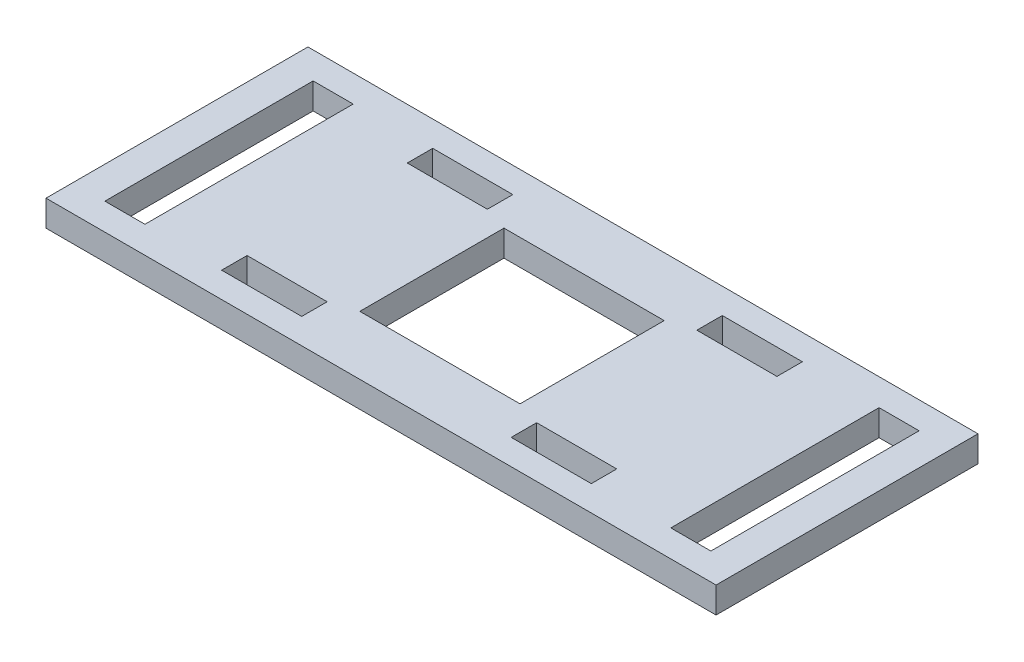
ISO-10303-21;
HEADER;
FILE_DESCRIPTION(('STEP AP214'),'2;1');
FILE_NAME('part.step','',(''),(''),'','','');
FILE_SCHEMA(('AUTOMOTIVE_DESIGN { 1 0 10303 214 1 1 1 1 }'));
ENDSEC;
DATA;
#1=APPLICATION_CONTEXT('core data for automotive mechanical design processes');
#2=APPLICATION_PROTOCOL_DEFINITION('international standard','automotive_design',2000,#1);
#3=PRODUCT_CONTEXT('',#1,'mechanical');
#4=PRODUCT('Part','Part','',(#3));
#5=PRODUCT_RELATED_PRODUCT_CATEGORY('part','',(#4));
#6=PRODUCT_DEFINITION_FORMATION('','',#4);
#7=PRODUCT_DEFINITION_CONTEXT('part definition',#1,'design');
#8=PRODUCT_DEFINITION('design','',#6,#7);
#9=PRODUCT_DEFINITION_SHAPE('','',#8);
#10=(LENGTH_UNIT() NAMED_UNIT(*) SI_UNIT(.MILLI.,.METRE.));
#11=(NAMED_UNIT(*) PLANE_ANGLE_UNIT() SI_UNIT($,.RADIAN.));
#12=(NAMED_UNIT(*) SI_UNIT($,.STERADIAN.) SOLID_ANGLE_UNIT());
#13=UNCERTAINTY_MEASURE_WITH_UNIT(LENGTH_MEASURE(1.E-05),#10,'distance_accuracy_value','');
#14=(GEOMETRIC_REPRESENTATION_CONTEXT(3) GLOBAL_UNCERTAINTY_ASSIGNED_CONTEXT((#13)) GLOBAL_UNIT_ASSIGNED_CONTEXT((#10,
#11,#12)) REPRESENTATION_CONTEXT('',''));
#15=CARTESIAN_POINT('',(0.,0.,0.));
#16=DIRECTION('',(0.,0.,1.));
#17=DIRECTION('',(1.,0.,0.));
#18=AXIS2_PLACEMENT_3D('',#15,#16,#17);
#19=CARTESIAN_POINT('',(0.,3.25,0.));
#20=DIRECTION('',(0.,-1.,0.));
#21=DIRECTION('',(0.,0.,-1.));
#22=AXIS2_PLACEMENT_3D('',#19,#20,#21);
#23=PLANE('',#22);
#24=DIRECTION('',(-1.,0.,0.));
#25=VECTOR('',#24,1.);
#26=CARTESIAN_POINT('',(-23.075,3.25,10.));
#27=LINE('',#26,#25);
#28=CARTESIAN_POINT('',(-13.075,3.25,10.));
#29=VERTEX_POINT('',#28);
#30=CARTESIAN_POINT('',(-23.075,3.25,10.));
#31=VERTEX_POINT('',#30);
#32=EDGE_CURVE('E277',#29,#31,#27,.T.);
#33=ORIENTED_EDGE('',*,*,#32,.F.);
#34=DIRECTION('',(0.,0.,-1.));
#35=VECTOR('',#34,1.);
#36=CARTESIAN_POINT('',(-13.075,3.25,10.));
#37=LINE('',#36,#35);
#38=CARTESIAN_POINT('',(-13.075,3.25,13.175));
#39=VERTEX_POINT('',#38);
#40=EDGE_CURVE('E285',#39,#29,#37,.T.);
#41=ORIENTED_EDGE('',*,*,#40,.F.);
#42=DIRECTION('',(1.,0.,0.));
#43=VECTOR('',#42,1.);
#44=CARTESIAN_POINT('',(-23.075,3.25,13.175));
#45=LINE('',#44,#43);
#46=CARTESIAN_POINT('',(-23.075,3.25,13.175));
#47=VERTEX_POINT('',#46);
#48=EDGE_CURVE('E282',#47,#39,#45,.T.);
#49=ORIENTED_EDGE('',*,*,#48,.F.);
#50=DIRECTION('',(0.,0.,1.));
#51=VECTOR('',#50,1.);
#52=CARTESIAN_POINT('',(-23.075,3.25,10.));
#53=LINE('',#52,#51);
#54=EDGE_CURVE('E279',#31,#47,#53,.T.);
#55=ORIENTED_EDGE('',*,*,#54,.F.);
#56=EDGE_LOOP('',(#33,#41,#49,#55));
#57=FACE_BOUND('',#56,.T.);
#58=DIRECTION('',(1.,0.,0.));
#59=VECTOR('',#58,1.);
#60=CARTESIAN_POINT('',(23.075,3.25,-10.));
#61=LINE('',#60,#59);
#62=CARTESIAN_POINT('',(13.075,3.25,-10.));
#63=VERTEX_POINT('',#62);
#64=CARTESIAN_POINT('',(23.075,3.25,-10.));
#65=VERTEX_POINT('',#64);
#66=EDGE_CURVE('E339',#63,#65,#61,.T.);
#67=ORIENTED_EDGE('',*,*,#66,.F.);
#68=DIRECTION('',(0.,0.,1.));
#69=VECTOR('',#68,1.);
#70=CARTESIAN_POINT('',(13.075,3.25,-10.));
#71=LINE('',#70,#69);
#72=CARTESIAN_POINT('',(13.075,3.25,-13.175));
#73=VERTEX_POINT('',#72);
#74=EDGE_CURVE('E347',#73,#63,#71,.T.);
#75=ORIENTED_EDGE('',*,*,#74,.F.);
#76=DIRECTION('',(-1.,0.,0.));
#77=VECTOR('',#76,1.);
#78=CARTESIAN_POINT('',(23.075,3.25,-13.175));
#79=LINE('',#78,#77);
#80=CARTESIAN_POINT('',(23.075,3.25,-13.175));
#81=VERTEX_POINT('',#80);
#82=EDGE_CURVE('E344',#81,#73,#79,.T.);
#83=ORIENTED_EDGE('',*,*,#82,.F.);
#84=DIRECTION('',(0.,0.,-1.));
#85=VECTOR('',#84,1.);
#86=CARTESIAN_POINT('',(23.075,3.25,-10.));
#87=LINE('',#86,#85);
#88=EDGE_CURVE('E341',#65,#81,#87,.T.);
#89=ORIENTED_EDGE('',*,*,#88,.F.);
#90=EDGE_LOOP('',(#67,#75,#83,#89));
#91=FACE_BOUND('',#90,.T.);
#92=DIRECTION('',(0.,0.,1.));
#93=VECTOR('',#92,1.);
#94=CARTESIAN_POINT('',(-23.075,3.25,-10.));
#95=LINE('',#94,#93);
#96=CARTESIAN_POINT('',(-23.075,3.25,-13.175));
#97=VERTEX_POINT('',#96);
#98=CARTESIAN_POINT('',(-23.075,3.25,-10.));
#99=VERTEX_POINT('',#98);
#100=EDGE_CURVE('E401',#97,#99,#95,.T.);
#101=ORIENTED_EDGE('',*,*,#100,.F.);
#102=DIRECTION('',(-1.,0.,0.));
#103=VECTOR('',#102,1.);
#104=CARTESIAN_POINT('',(-23.075,3.25,-13.175));
#105=LINE('',#104,#103);
#106=CARTESIAN_POINT('',(-13.075,3.25,-13.175));
#107=VERTEX_POINT('',#106);
#108=EDGE_CURVE('E409',#107,#97,#105,.T.);
#109=ORIENTED_EDGE('',*,*,#108,.F.);
#110=DIRECTION('',(0.,0.,-1.));
#111=VECTOR('',#110,1.);
#112=CARTESIAN_POINT('',(-13.075,3.25,-10.));
#113=LINE('',#112,#111);
#114=CARTESIAN_POINT('',(-13.075,3.25,-10.));
#115=VERTEX_POINT('',#114);
#116=EDGE_CURVE('E406',#115,#107,#113,.T.);
#117=ORIENTED_EDGE('',*,*,#116,.F.);
#118=DIRECTION('',(1.,0.,0.));
#119=VECTOR('',#118,1.);
#120=CARTESIAN_POINT('',(-23.075,3.25,-10.));
#121=LINE('',#120,#119);
#122=EDGE_CURVE('E403',#99,#115,#121,.T.);
#123=ORIENTED_EDGE('',*,*,#122,.F.);
#124=EDGE_LOOP('',(#101,#109,#117,#123));
#125=FACE_BOUND('',#124,.T.);
#126=DIRECTION('',(0.,0.,-1.));
#127=VECTOR('',#126,1.);
#128=CARTESIAN_POINT('',(41.825,3.25,16.35));
#129=LINE('',#128,#127);
#130=CARTESIAN_POINT('',(41.825,3.25,16.35));
#131=VERTEX_POINT('',#130);
#132=CARTESIAN_POINT('',(41.825,3.25,-16.35));
#133=VERTEX_POINT('',#132);
#134=EDGE_CURVE('E463',#131,#133,#129,.T.);
#135=ORIENTED_EDGE('',*,*,#134,.T.);
#136=DIRECTION('',(-1.,0.,0.));
#137=VECTOR('',#136,1.);
#138=CARTESIAN_POINT('',(-41.825,3.25,-16.35));
#139=LINE('',#138,#137);
#140=CARTESIAN_POINT('',(-41.825,3.25,-16.35));
#141=VERTEX_POINT('',#140);
#142=EDGE_CURVE('E466',#133,#141,#139,.T.);
#143=ORIENTED_EDGE('',*,*,#142,.T.);
#144=DIRECTION('',(0.,0.,1.));
#145=VECTOR('',#144,1.);
#146=CARTESIAN_POINT('',(-41.825,3.25,16.35));
#147=LINE('',#146,#145);
#148=CARTESIAN_POINT('',(-41.825,3.25,16.35));
#149=VERTEX_POINT('',#148);
#150=EDGE_CURVE('E469',#141,#149,#147,.T.);
#151=ORIENTED_EDGE('',*,*,#150,.T.);
#152=DIRECTION('',(1.,0.,0.));
#153=VECTOR('',#152,1.);
#154=CARTESIAN_POINT('',(-41.825,3.25,16.35));
#155=LINE('',#154,#153);
#156=EDGE_CURVE('E471',#149,#131,#155,.T.);
#157=ORIENTED_EDGE('',*,*,#156,.T.);
#158=EDGE_LOOP('',(#135,#143,#151,#157));
#159=FACE_BOUND('',#158,.T.);
#160=DIRECTION('',(0.,0.,-1.));
#161=VECTOR('',#160,1.);
#162=CARTESIAN_POINT('',(-32.825,3.25,13.));
#163=LINE('',#162,#161);
#164=CARTESIAN_POINT('',(-32.825,3.25,13.));
#165=VERTEX_POINT('',#164);
#166=CARTESIAN_POINT('',(-32.825,3.25,-13.));
#167=VERTEX_POINT('',#166);
#168=EDGE_CURVE('E432',#165,#167,#163,.T.);
#169=ORIENTED_EDGE('',*,*,#168,.F.);
#170=DIRECTION('',(1.,0.,0.));
#171=VECTOR('',#170,1.);
#172=CARTESIAN_POINT('',(-37.825,3.25,13.));
#173=LINE('',#172,#171);
#174=CARTESIAN_POINT('',(-37.825,3.25,13.));
#175=VERTEX_POINT('',#174);
#176=EDGE_CURVE('E440',#175,#165,#173,.T.);
#177=ORIENTED_EDGE('',*,*,#176,.F.);
#178=DIRECTION('',(0.,0.,1.));
#179=VECTOR('',#178,1.);
#180=CARTESIAN_POINT('',(-37.825,3.25,13.));
#181=LINE('',#180,#179);
#182=CARTESIAN_POINT('',(-37.825,3.25,-13.));
#183=VERTEX_POINT('',#182);
#184=EDGE_CURVE('E437',#183,#175,#181,.T.);
#185=ORIENTED_EDGE('',*,*,#184,.F.);
#186=DIRECTION('',(-1.,0.,0.));
#187=VECTOR('',#186,1.);
#188=CARTESIAN_POINT('',(-37.825,3.25,-13.));
#189=LINE('',#188,#187);
#190=EDGE_CURVE('E434',#167,#183,#189,.T.);
#191=ORIENTED_EDGE('',*,*,#190,.F.);
#192=EDGE_LOOP('',(#169,#177,#185,#191));
#193=FACE_BOUND('',#192,.T.);
#194=DIRECTION('',(0.,0.,-1.));
#195=VECTOR('',#194,1.);
#196=CARTESIAN_POINT('',(37.825,3.25,13.));
#197=LINE('',#196,#195);
#198=CARTESIAN_POINT('',(37.825,3.25,13.));
#199=VERTEX_POINT('',#198);
#200=CARTESIAN_POINT('',(37.825,3.25,-13.));
#201=VERTEX_POINT('',#200);
#202=EDGE_CURVE('E370',#199,#201,#197,.T.);
#203=ORIENTED_EDGE('',*,*,#202,.F.);
#204=DIRECTION('',(1.,0.,0.));
#205=VECTOR('',#204,1.);
#206=CARTESIAN_POINT('',(37.825,3.25,13.));
#207=LINE('',#206,#205);
#208=CARTESIAN_POINT('',(32.825,3.25,13.));
#209=VERTEX_POINT('',#208);
#210=EDGE_CURVE('E378',#209,#199,#207,.T.);
#211=ORIENTED_EDGE('',*,*,#210,.F.);
#212=DIRECTION('',(0.,0.,1.));
#213=VECTOR('',#212,1.);
#214=CARTESIAN_POINT('',(32.825,3.25,13.));
#215=LINE('',#214,#213);
#216=CARTESIAN_POINT('',(32.825,3.25,-13.));
#217=VERTEX_POINT('',#216);
#218=EDGE_CURVE('E375',#217,#209,#215,.T.);
#219=ORIENTED_EDGE('',*,*,#218,.F.);
#220=DIRECTION('',(-1.,0.,0.));
#221=VECTOR('',#220,1.);
#222=CARTESIAN_POINT('',(37.825,3.25,-13.));
#223=LINE('',#222,#221);
#224=EDGE_CURVE('E372',#201,#217,#223,.T.);
#225=ORIENTED_EDGE('',*,*,#224,.F.);
#226=EDGE_LOOP('',(#203,#211,#219,#225));
#227=FACE_BOUND('',#226,.T.);
#228=DIRECTION('',(0.,0.,-1.));
#229=VECTOR('',#228,1.);
#230=CARTESIAN_POINT('',(23.075,3.25,10.));
#231=LINE('',#230,#229);
#232=CARTESIAN_POINT('',(23.075,3.25,13.175));
#233=VERTEX_POINT('',#232);
#234=CARTESIAN_POINT('',(23.075,3.25,10.));
#235=VERTEX_POINT('',#234);
#236=EDGE_CURVE('E308',#233,#235,#231,.T.);
#237=ORIENTED_EDGE('',*,*,#236,.F.);
#238=DIRECTION('',(1.,0.,0.));
#239=VECTOR('',#238,1.);
#240=CARTESIAN_POINT('',(23.075,3.25,13.175));
#241=LINE('',#240,#239);
#242=CARTESIAN_POINT('',(13.075,3.25,13.175));
#243=VERTEX_POINT('',#242);
#244=EDGE_CURVE('E316',#243,#233,#241,.T.);
#245=ORIENTED_EDGE('',*,*,#244,.F.);
#246=DIRECTION('',(0.,0.,1.));
#247=VECTOR('',#246,1.);
#248=CARTESIAN_POINT('',(13.075,3.25,10.));
#249=LINE('',#248,#247);
#250=CARTESIAN_POINT('',(13.075,3.25,10.));
#251=VERTEX_POINT('',#250);
#252=EDGE_CURVE('E313',#251,#243,#249,.T.);
#253=ORIENTED_EDGE('',*,*,#252,.F.);
#254=DIRECTION('',(-1.,0.,0.));
#255=VECTOR('',#254,1.);
#256=CARTESIAN_POINT('',(23.075,3.25,10.));
#257=LINE('',#256,#255);
#258=EDGE_CURVE('E310',#235,#251,#257,.T.);
#259=ORIENTED_EDGE('',*,*,#258,.F.);
#260=EDGE_LOOP('',(#237,#245,#253,#259));
#261=FACE_BOUND('',#260,.T.);
#262=DIRECTION('',(0.,0.,-1.));
#263=VECTOR('',#262,1.);
#264=CARTESIAN_POINT('',(10.,3.25,8.99999999999999));
#265=LINE('',#264,#263);
#266=CARTESIAN_POINT('',(10.,3.25,8.99999999999999));
#267=VERTEX_POINT('',#266);
#268=CARTESIAN_POINT('',(10.,3.25,-9.00000000000001));
#269=VERTEX_POINT('',#268);
#270=EDGE_CURVE('E241',#267,#269,#265,.T.);
#271=ORIENTED_EDGE('',*,*,#270,.F.);
#272=DIRECTION('',(1.,0.,0.));
#273=VECTOR('',#272,1.);
#274=CARTESIAN_POINT('',(-10.,3.25,8.99999999999999));
#275=LINE('',#274,#273);
#276=CARTESIAN_POINT('',(-10.,3.25,8.99999999999999));
#277=VERTEX_POINT('',#276);
#278=EDGE_CURVE('E263',#277,#267,#275,.T.);
#279=ORIENTED_EDGE('',*,*,#278,.F.);
#280=DIRECTION('',(0.,0.,1.));
#281=VECTOR('',#280,1.);
#282=CARTESIAN_POINT('',(-10.,3.25,8.99999999999999));
#283=LINE('',#282,#281);
#284=CARTESIAN_POINT('',(-10.,3.25,-9.00000000000001));
#285=VERTEX_POINT('',#284);
#286=EDGE_CURVE('E261',#285,#277,#283,.T.);
#287=ORIENTED_EDGE('',*,*,#286,.F.);
#288=DIRECTION('',(-1.,0.,0.));
#289=VECTOR('',#288,1.);
#290=CARTESIAN_POINT('',(-10.,3.25,-9.00000000000001));
#291=LINE('',#290,#289);
#292=EDGE_CURVE('E249',#269,#285,#291,.T.);
#293=ORIENTED_EDGE('',*,*,#292,.F.);
#294=EDGE_LOOP('',(#271,#279,#287,#293));
#295=FACE_BOUND('',#294,.T.);
#296=ADVANCED_FACE('F32',(#57,#91,#125,#159,#193,#227,#261,#295),#23,.F.);
#297=CARTESIAN_POINT('',(0.,0.,0.));
#298=DIRECTION('',(0.,-1.,0.));
#299=DIRECTION('',(0.,0.,-1.));
#300=AXIS2_PLACEMENT_3D('',#297,#298,#299);
#301=PLANE('',#300);
#302=DIRECTION('',(0.,0.,-1.));
#303=VECTOR('',#302,1.);
#304=CARTESIAN_POINT('',(41.825,0.,16.35));
#305=LINE('',#304,#303);
#306=CARTESIAN_POINT('',(41.825,0.,16.35));
#307=VERTEX_POINT('',#306);
#308=CARTESIAN_POINT('',(41.825,0.,-16.35));
#309=VERTEX_POINT('',#308);
#310=EDGE_CURVE('E462',#307,#309,#305,.T.);
#311=ORIENTED_EDGE('',*,*,#310,.F.);
#312=DIRECTION('',(1.,0.,0.));
#313=VECTOR('',#312,1.);
#314=CARTESIAN_POINT('',(-41.825,0.,16.35));
#315=LINE('',#314,#313);
#316=CARTESIAN_POINT('',(-41.825,0.,16.35));
#317=VERTEX_POINT('',#316);
#318=EDGE_CURVE('E467',#317,#307,#315,.T.);
#319=ORIENTED_EDGE('',*,*,#318,.F.);
#320=DIRECTION('',(0.,0.,1.));
#321=VECTOR('',#320,1.);
#322=CARTESIAN_POINT('',(-41.825,0.,16.35));
#323=LINE('',#322,#321);
#324=CARTESIAN_POINT('',(-41.825,0.,-16.35));
#325=VERTEX_POINT('',#324);
#326=EDGE_CURVE('E478',#325,#317,#323,.T.);
#327=ORIENTED_EDGE('',*,*,#326,.F.);
#328=DIRECTION('',(-1.,0.,0.));
#329=VECTOR('',#328,1.);
#330=CARTESIAN_POINT('',(-41.825,0.,-16.35));
#331=LINE('',#330,#329);
#332=EDGE_CURVE('E476',#309,#325,#331,.T.);
#333=ORIENTED_EDGE('',*,*,#332,.F.);
#334=EDGE_LOOP('',(#311,#319,#327,#333));
#335=FACE_BOUND('',#334,.T.);
#336=DIRECTION('',(1.,0.,0.));
#337=VECTOR('',#336,1.);
#338=CARTESIAN_POINT('',(-37.825,0.,13.));
#339=LINE('',#338,#337);
#340=CARTESIAN_POINT('',(-37.825,0.,13.));
#341=VERTEX_POINT('',#340);
#342=CARTESIAN_POINT('',(-32.825,0.,13.));
#343=VERTEX_POINT('',#342);
#344=EDGE_CURVE('E435',#341,#343,#339,.T.);
#345=ORIENTED_EDGE('',*,*,#344,.T.);
#346=DIRECTION('',(0.,0.,-1.));
#347=VECTOR('',#346,1.);
#348=CARTESIAN_POINT('',(-32.825,0.,13.));
#349=LINE('',#348,#347);
#350=CARTESIAN_POINT('',(-32.825,0.,-13.));
#351=VERTEX_POINT('',#350);
#352=EDGE_CURVE('E431',#343,#351,#349,.T.);
#353=ORIENTED_EDGE('',*,*,#352,.T.);
#354=DIRECTION('',(-1.,0.,0.));
#355=VECTOR('',#354,1.);
#356=CARTESIAN_POINT('',(-37.825,0.,-13.));
#357=LINE('',#356,#355);
#358=CARTESIAN_POINT('',(-37.825,0.,-13.));
#359=VERTEX_POINT('',#358);
#360=EDGE_CURVE('E445',#351,#359,#357,.T.);
#361=ORIENTED_EDGE('',*,*,#360,.T.);
#362=DIRECTION('',(0.,0.,1.));
#363=VECTOR('',#362,1.);
#364=CARTESIAN_POINT('',(-37.825,0.,13.));
#365=LINE('',#364,#363);
#366=EDGE_CURVE('E448',#359,#341,#365,.T.);
#367=ORIENTED_EDGE('',*,*,#366,.T.);
#368=EDGE_LOOP('',(#345,#353,#361,#367));
#369=FACE_BOUND('',#368,.T.);
#370=DIRECTION('',(-1.,0.,0.));
#371=VECTOR('',#370,1.);
#372=CARTESIAN_POINT('',(-23.075,0.,-13.175));
#373=LINE('',#372,#371);
#374=CARTESIAN_POINT('',(-13.075,0.,-13.175));
#375=VERTEX_POINT('',#374);
#376=CARTESIAN_POINT('',(-23.075,0.,-13.175));
#377=VERTEX_POINT('',#376);
#378=EDGE_CURVE('E404',#375,#377,#373,.T.);
#379=ORIENTED_EDGE('',*,*,#378,.T.);
#380=DIRECTION('',(0.,0.,1.));
#381=VECTOR('',#380,1.);
#382=CARTESIAN_POINT('',(-23.075,0.,-10.));
#383=LINE('',#382,#381);
#384=CARTESIAN_POINT('',(-23.075,0.,-10.));
#385=VERTEX_POINT('',#384);
#386=EDGE_CURVE('E400',#377,#385,#383,.T.);
#387=ORIENTED_EDGE('',*,*,#386,.T.);
#388=DIRECTION('',(1.,0.,0.));
#389=VECTOR('',#388,1.);
#390=CARTESIAN_POINT('',(-23.075,0.,-10.));
#391=LINE('',#390,#389);
#392=CARTESIAN_POINT('',(-13.075,0.,-10.));
#393=VERTEX_POINT('',#392);
#394=EDGE_CURVE('E414',#385,#393,#391,.T.);
#395=ORIENTED_EDGE('',*,*,#394,.T.);
#396=DIRECTION('',(0.,0.,-1.));
#397=VECTOR('',#396,1.);
#398=CARTESIAN_POINT('',(-13.075,0.,-10.));
#399=LINE('',#398,#397);
#400=EDGE_CURVE('E417',#393,#375,#399,.T.);
#401=ORIENTED_EDGE('',*,*,#400,.T.);
#402=EDGE_LOOP('',(#379,#387,#395,#401));
#403=FACE_BOUND('',#402,.T.);
#404=DIRECTION('',(1.,0.,0.));
#405=VECTOR('',#404,1.);
#406=CARTESIAN_POINT('',(37.825,0.,13.));
#407=LINE('',#406,#405);
#408=CARTESIAN_POINT('',(32.825,0.,13.));
#409=VERTEX_POINT('',#408);
#410=CARTESIAN_POINT('',(37.825,0.,13.));
#411=VERTEX_POINT('',#410);
#412=EDGE_CURVE('E373',#409,#411,#407,.T.);
#413=ORIENTED_EDGE('',*,*,#412,.T.);
#414=DIRECTION('',(0.,0.,-1.));
#415=VECTOR('',#414,1.);
#416=CARTESIAN_POINT('',(37.825,0.,13.));
#417=LINE('',#416,#415);
#418=CARTESIAN_POINT('',(37.825,0.,-13.));
#419=VERTEX_POINT('',#418);
#420=EDGE_CURVE('E369',#411,#419,#417,.T.);
#421=ORIENTED_EDGE('',*,*,#420,.T.);
#422=DIRECTION('',(-1.,0.,0.));
#423=VECTOR('',#422,1.);
#424=CARTESIAN_POINT('',(37.825,0.,-13.));
#425=LINE('',#424,#423);
#426=CARTESIAN_POINT('',(32.825,0.,-13.));
#427=VERTEX_POINT('',#426);
#428=EDGE_CURVE('E383',#419,#427,#425,.T.);
#429=ORIENTED_EDGE('',*,*,#428,.T.);
#430=DIRECTION('',(0.,0.,1.));
#431=VECTOR('',#430,1.);
#432=CARTESIAN_POINT('',(32.825,0.,13.));
#433=LINE('',#432,#431);
#434=EDGE_CURVE('E386',#427,#409,#433,.T.);
#435=ORIENTED_EDGE('',*,*,#434,.T.);
#436=EDGE_LOOP('',(#413,#421,#429,#435));
#437=FACE_BOUND('',#436,.T.);
#438=DIRECTION('',(0.,0.,1.));
#439=VECTOR('',#438,1.);
#440=CARTESIAN_POINT('',(13.075,0.,-10.));
#441=LINE('',#440,#439);
#442=CARTESIAN_POINT('',(13.075,0.,-13.175));
#443=VERTEX_POINT('',#442);
#444=CARTESIAN_POINT('',(13.075,0.,-10.));
#445=VERTEX_POINT('',#444);
#446=EDGE_CURVE('E342',#443,#445,#441,.T.);
#447=ORIENTED_EDGE('',*,*,#446,.T.);
#448=DIRECTION('',(1.,0.,0.));
#449=VECTOR('',#448,1.);
#450=CARTESIAN_POINT('',(23.075,0.,-10.));
#451=LINE('',#450,#449);
#452=CARTESIAN_POINT('',(23.075,0.,-10.));
#453=VERTEX_POINT('',#452);
#454=EDGE_CURVE('E338',#445,#453,#451,.T.);
#455=ORIENTED_EDGE('',*,*,#454,.T.);
#456=DIRECTION('',(0.,0.,-1.));
#457=VECTOR('',#456,1.);
#458=CARTESIAN_POINT('',(23.075,0.,-10.));
#459=LINE('',#458,#457);
#460=CARTESIAN_POINT('',(23.075,0.,-13.175));
#461=VERTEX_POINT('',#460);
#462=EDGE_CURVE('E352',#453,#461,#459,.T.);
#463=ORIENTED_EDGE('',*,*,#462,.T.);
#464=DIRECTION('',(-1.,0.,0.));
#465=VECTOR('',#464,1.);
#466=CARTESIAN_POINT('',(23.075,0.,-13.175));
#467=LINE('',#466,#465);
#468=EDGE_CURVE('E355',#461,#443,#467,.T.);
#469=ORIENTED_EDGE('',*,*,#468,.T.);
#470=EDGE_LOOP('',(#447,#455,#463,#469));
#471=FACE_BOUND('',#470,.T.);
#472=DIRECTION('',(1.,0.,0.));
#473=VECTOR('',#472,1.);
#474=CARTESIAN_POINT('',(23.075,0.,13.175));
#475=LINE('',#474,#473);
#476=CARTESIAN_POINT('',(13.075,0.,13.175));
#477=VERTEX_POINT('',#476);
#478=CARTESIAN_POINT('',(23.075,0.,13.175));
#479=VERTEX_POINT('',#478);
#480=EDGE_CURVE('E311',#477,#479,#475,.T.);
#481=ORIENTED_EDGE('',*,*,#480,.T.);
#482=DIRECTION('',(0.,0.,-1.));
#483=VECTOR('',#482,1.);
#484=CARTESIAN_POINT('',(23.075,0.,10.));
#485=LINE('',#484,#483);
#486=CARTESIAN_POINT('',(23.075,0.,10.));
#487=VERTEX_POINT('',#486);
#488=EDGE_CURVE('E307',#479,#487,#485,.T.);
#489=ORIENTED_EDGE('',*,*,#488,.T.);
#490=DIRECTION('',(-1.,0.,0.));
#491=VECTOR('',#490,1.);
#492=CARTESIAN_POINT('',(23.075,0.,10.));
#493=LINE('',#492,#491);
#494=CARTESIAN_POINT('',(13.075,0.,10.));
#495=VERTEX_POINT('',#494);
#496=EDGE_CURVE('E321',#487,#495,#493,.T.);
#497=ORIENTED_EDGE('',*,*,#496,.T.);
#498=DIRECTION('',(0.,0.,1.));
#499=VECTOR('',#498,1.);
#500=CARTESIAN_POINT('',(13.075,0.,10.));
#501=LINE('',#500,#499);
#502=EDGE_CURVE('E324',#495,#477,#501,.T.);
#503=ORIENTED_EDGE('',*,*,#502,.T.);
#504=EDGE_LOOP('',(#481,#489,#497,#503));
#505=FACE_BOUND('',#504,.T.);
#506=DIRECTION('',(0.,0.,-1.));
#507=VECTOR('',#506,1.);
#508=CARTESIAN_POINT('',(-13.075,0.,10.));
#509=LINE('',#508,#507);
#510=CARTESIAN_POINT('',(-13.075,0.,13.175));
#511=VERTEX_POINT('',#510);
#512=CARTESIAN_POINT('',(-13.075,0.,10.));
#513=VERTEX_POINT('',#512);
#514=EDGE_CURVE('E280',#511,#513,#509,.T.);
#515=ORIENTED_EDGE('',*,*,#514,.T.);
#516=DIRECTION('',(-1.,0.,0.));
#517=VECTOR('',#516,1.);
#518=CARTESIAN_POINT('',(-23.075,0.,10.));
#519=LINE('',#518,#517);
#520=CARTESIAN_POINT('',(-23.075,0.,10.));
#521=VERTEX_POINT('',#520);
#522=EDGE_CURVE('E257',#513,#521,#519,.T.);
#523=ORIENTED_EDGE('',*,*,#522,.T.);
#524=DIRECTION('',(0.,0.,1.));
#525=VECTOR('',#524,1.);
#526=CARTESIAN_POINT('',(-23.075,0.,10.));
#527=LINE('',#526,#525);
#528=CARTESIAN_POINT('',(-23.075,0.,13.175));
#529=VERTEX_POINT('',#528);
#530=EDGE_CURVE('E290',#521,#529,#527,.T.);
#531=ORIENTED_EDGE('',*,*,#530,.T.);
#532=DIRECTION('',(1.,0.,0.));
#533=VECTOR('',#532,1.);
#534=CARTESIAN_POINT('',(-23.075,0.,13.175));
#535=LINE('',#534,#533);
#536=EDGE_CURVE('E293',#529,#511,#535,.T.);
#537=ORIENTED_EDGE('',*,*,#536,.T.);
#538=EDGE_LOOP('',(#515,#523,#531,#537));
#539=FACE_BOUND('',#538,.T.);
#540=DIRECTION('',(1.,0.,0.));
#541=VECTOR('',#540,1.);
#542=CARTESIAN_POINT('',(-10.,0.,8.99999999999999));
#543=LINE('',#542,#541);
#544=CARTESIAN_POINT('',(-10.,0.,8.99999999999999));
#545=VERTEX_POINT('',#544);
#546=CARTESIAN_POINT('',(10.,0.,8.99999999999999));
#547=VERTEX_POINT('',#546);
#548=EDGE_CURVE('E250',#545,#547,#543,.T.);
#549=ORIENTED_EDGE('',*,*,#548,.T.);
#550=DIRECTION('',(0.,0.,-1.));
#551=VECTOR('',#550,1.);
#552=CARTESIAN_POINT('',(10.,0.,8.99999999999999));
#553=LINE('',#552,#551);
#554=CARTESIAN_POINT('',(10.,0.,-9.00000000000001));
#555=VERTEX_POINT('',#554);
#556=EDGE_CURVE('E55',#547,#555,#553,.T.);
#557=ORIENTED_EDGE('',*,*,#556,.T.);
#558=DIRECTION('',(-1.,0.,0.));
#559=VECTOR('',#558,1.);
#560=CARTESIAN_POINT('',(-10.,0.,-9.00000000000001));
#561=LINE('',#560,#559);
#562=CARTESIAN_POINT('',(-10.,0.,-9.00000000000001));
#563=VERTEX_POINT('',#562);
#564=EDGE_CURVE('E256',#555,#563,#561,.T.);
#565=ORIENTED_EDGE('',*,*,#564,.T.);
#566=DIRECTION('',(0.,0.,1.));
#567=VECTOR('',#566,1.);
#568=CARTESIAN_POINT('',(-10.,0.,8.99999999999999));
#569=LINE('',#568,#567);
#570=EDGE_CURVE('E269',#563,#545,#569,.T.);
#571=ORIENTED_EDGE('',*,*,#570,.T.);
#572=EDGE_LOOP('',(#549,#557,#565,#571));
#573=FACE_BOUND('',#572,.T.);
#574=ADVANCED_FACE('F496',(#335,#369,#403,#437,#471,#505,#539,#573),#301,.T.);
#575=CARTESIAN_POINT('',(41.825,3.25,16.35));
#576=DIRECTION('',(-1.,0.,0.));
#577=DIRECTION('',(0.,0.,1.));
#578=AXIS2_PLACEMENT_3D('',#575,#576,#577);
#579=PLANE('',#578);
#580=ORIENTED_EDGE('',*,*,#310,.T.);
#581=DIRECTION('',(0.,-1.,0.));
#582=VECTOR('',#581,1.);
#583=CARTESIAN_POINT('',(41.825,3.25,-16.35));
#584=LINE('',#583,#582);
#585=EDGE_CURVE('E11',#133,#309,#584,.T.);
#586=ORIENTED_EDGE('',*,*,#585,.F.);
#587=ORIENTED_EDGE('',*,*,#134,.F.);
#588=DIRECTION('',(0.,-1.,0.));
#589=VECTOR('',#588,1.);
#590=CARTESIAN_POINT('',(41.825,3.25,16.35));
#591=LINE('',#590,#589);
#592=EDGE_CURVE('E473',#131,#307,#591,.T.);
#593=ORIENTED_EDGE('',*,*,#592,.T.);
#594=EDGE_LOOP('',(#580,#586,#587,#593));
#595=FACE_BOUND('',#594,.T.);
#596=ADVANCED_FACE('F34',(#595),#579,.F.);
#597=CARTESIAN_POINT('',(-41.825,3.25,-16.35));
#598=DIRECTION('',(0.,0.,1.));
#599=DIRECTION('',(1.,0.,0.));
#600=AXIS2_PLACEMENT_3D('',#597,#598,#599);
#601=PLANE('',#600);
#602=ORIENTED_EDGE('',*,*,#332,.T.);
#603=DIRECTION('',(0.,-1.,0.));
#604=VECTOR('',#603,1.);
#605=CARTESIAN_POINT('',(-41.825,3.25,-16.35));
#606=LINE('',#605,#604);
#607=EDGE_CURVE('E40',#141,#325,#606,.T.);
#608=ORIENTED_EDGE('',*,*,#607,.F.);
#609=ORIENTED_EDGE('',*,*,#142,.F.);
#610=ORIENTED_EDGE('',*,*,#585,.T.);
#611=EDGE_LOOP('',(#602,#608,#609,#610));
#612=FACE_BOUND('',#611,.T.);
#613=ADVANCED_FACE('F507',(#612),#601,.F.);
#614=CARTESIAN_POINT('',(-41.825,3.25,16.35));
#615=DIRECTION('',(1.,0.,0.));
#616=DIRECTION('',(0.,0.,-1.));
#617=AXIS2_PLACEMENT_3D('',#614,#615,#616);
#618=PLANE('',#617);
#619=ORIENTED_EDGE('',*,*,#326,.T.);
#620=DIRECTION('',(0.,-1.,0.));
#621=VECTOR('',#620,1.);
#622=CARTESIAN_POINT('',(-41.825,3.25,16.35));
#623=LINE('',#622,#621);
#624=EDGE_CURVE('E483',#149,#317,#623,.T.);
#625=ORIENTED_EDGE('',*,*,#624,.F.);
#626=ORIENTED_EDGE('',*,*,#150,.F.);
#627=ORIENTED_EDGE('',*,*,#607,.T.);
#628=EDGE_LOOP('',(#619,#625,#626,#627));
#629=FACE_BOUND('',#628,.T.);
#630=ADVANCED_FACE('F490',(#629),#618,.F.);
#631=CARTESIAN_POINT('',(-41.825,3.25,16.35));
#632=DIRECTION('',(0.,0.,-1.));
#633=DIRECTION('',(-1.,0.,0.));
#634=AXIS2_PLACEMENT_3D('',#631,#632,#633);
#635=PLANE('',#634);
#636=ORIENTED_EDGE('',*,*,#318,.T.);
#637=ORIENTED_EDGE('',*,*,#592,.F.);
#638=ORIENTED_EDGE('',*,*,#156,.F.);
#639=ORIENTED_EDGE('',*,*,#624,.T.);
#640=EDGE_LOOP('',(#636,#637,#638,#639));
#641=FACE_BOUND('',#640,.T.);
#642=ADVANCED_FACE('F500',(#641),#635,.F.);
#643=CARTESIAN_POINT('',(-32.825,3.25,13.));
#644=DIRECTION('',(-1.,0.,0.));
#645=DIRECTION('',(0.,0.,1.));
#646=AXIS2_PLACEMENT_3D('',#643,#644,#645);
#647=PLANE('',#646);
#648=ORIENTED_EDGE('',*,*,#352,.F.);
#649=DIRECTION('',(0.,-1.,0.));
#650=VECTOR('',#649,1.);
#651=CARTESIAN_POINT('',(-32.825,3.25,13.));
#652=LINE('',#651,#650);
#653=EDGE_CURVE('E442',#165,#343,#652,.T.);
#654=ORIENTED_EDGE('',*,*,#653,.F.);
#655=ORIENTED_EDGE('',*,*,#168,.T.);
#656=DIRECTION('',(0.,-1.,0.));
#657=VECTOR('',#656,1.);
#658=CARTESIAN_POINT('',(-32.825,3.25,-13.));
#659=LINE('',#658,#657);
#660=EDGE_CURVE('E459',#167,#351,#659,.T.);
#661=ORIENTED_EDGE('',*,*,#660,.T.);
#662=EDGE_LOOP('',(#648,#654,#655,#661));
#663=FACE_BOUND('',#662,.T.);
#664=ADVANCED_FACE('F524',(#663),#647,.T.);
#665=CARTESIAN_POINT('',(-37.825,3.25,-13.));
#666=DIRECTION('',(0.,0.,1.));
#667=DIRECTION('',(1.,0.,0.));
#668=AXIS2_PLACEMENT_3D('',#665,#666,#667);
#669=PLANE('',#668);
#670=ORIENTED_EDGE('',*,*,#360,.F.);
#671=ORIENTED_EDGE('',*,*,#660,.F.);
#672=ORIENTED_EDGE('',*,*,#190,.T.);
#673=DIRECTION('',(0.,-1.,0.));
#674=VECTOR('',#673,1.);
#675=CARTESIAN_POINT('',(-37.825,3.25,-13.));
#676=LINE('',#675,#674);
#677=EDGE_CURVE('E457',#183,#359,#676,.T.);
#678=ORIENTED_EDGE('',*,*,#677,.T.);
#679=EDGE_LOOP('',(#670,#671,#672,#678));
#680=FACE_BOUND('',#679,.T.);
#681=ADVANCED_FACE('F531',(#680),#669,.T.);
#682=CARTESIAN_POINT('',(-37.825,3.25,13.));
#683=DIRECTION('',(1.,0.,0.));
#684=DIRECTION('',(0.,0.,-1.));
#685=AXIS2_PLACEMENT_3D('',#682,#683,#684);
#686=PLANE('',#685);
#687=ORIENTED_EDGE('',*,*,#366,.F.);
#688=ORIENTED_EDGE('',*,*,#677,.F.);
#689=ORIENTED_EDGE('',*,*,#184,.T.);
#690=DIRECTION('',(0.,-1.,0.));
#691=VECTOR('',#690,1.);
#692=CARTESIAN_POINT('',(-37.825,3.25,13.));
#693=LINE('',#692,#691);
#694=EDGE_CURVE('E455',#175,#341,#693,.T.);
#695=ORIENTED_EDGE('',*,*,#694,.T.);
#696=EDGE_LOOP('',(#687,#688,#689,#695));
#697=FACE_BOUND('',#696,.T.);
#698=ADVANCED_FACE('F536',(#697),#686,.T.);
#699=CARTESIAN_POINT('',(-37.825,3.25,13.));
#700=DIRECTION('',(0.,0.,-1.));
#701=DIRECTION('',(-1.,0.,0.));
#702=AXIS2_PLACEMENT_3D('',#699,#700,#701);
#703=PLANE('',#702);
#704=ORIENTED_EDGE('',*,*,#344,.F.);
#705=ORIENTED_EDGE('',*,*,#694,.F.);
#706=ORIENTED_EDGE('',*,*,#176,.T.);
#707=ORIENTED_EDGE('',*,*,#653,.T.);
#708=EDGE_LOOP('',(#704,#705,#706,#707));
#709=FACE_BOUND('',#708,.T.);
#710=ADVANCED_FACE('F543',(#709),#703,.T.);
#711=CARTESIAN_POINT('',(-23.075,3.25,-10.));
#712=DIRECTION('',(1.,0.,0.));
#713=DIRECTION('',(0.,0.,-1.));
#714=AXIS2_PLACEMENT_3D('',#711,#712,#713);
#715=PLANE('',#714);
#716=ORIENTED_EDGE('',*,*,#386,.F.);
#717=DIRECTION('',(0.,-1.,0.));
#718=VECTOR('',#717,1.);
#719=CARTESIAN_POINT('',(-23.075,3.25,-13.175));
#720=LINE('',#719,#718);
#721=EDGE_CURVE('E411',#97,#377,#720,.T.);
#722=ORIENTED_EDGE('',*,*,#721,.F.);
#723=ORIENTED_EDGE('',*,*,#100,.T.);
#724=DIRECTION('',(0.,-1.,0.));
#725=VECTOR('',#724,1.);
#726=CARTESIAN_POINT('',(-23.075,3.25,-10.));
#727=LINE('',#726,#725);
#728=EDGE_CURVE('E428',#99,#385,#727,.T.);
#729=ORIENTED_EDGE('',*,*,#728,.T.);
#730=EDGE_LOOP('',(#716,#722,#723,#729));
#731=FACE_BOUND('',#730,.T.);
#732=ADVANCED_FACE('F631',(#731),#715,.T.);
#733=CARTESIAN_POINT('',(-23.075,3.25,-10.));
#734=DIRECTION('',(0.,0.,-1.));
#735=DIRECTION('',(-1.,0.,0.));
#736=AXIS2_PLACEMENT_3D('',#733,#734,#735);
#737=PLANE('',#736);
#738=ORIENTED_EDGE('',*,*,#394,.F.);
#739=ORIENTED_EDGE('',*,*,#728,.F.);
#740=ORIENTED_EDGE('',*,*,#122,.T.);
#741=DIRECTION('',(0.,-1.,0.));
#742=VECTOR('',#741,1.);
#743=CARTESIAN_POINT('',(-13.075,3.25,-10.));
#744=LINE('',#743,#742);
#745=EDGE_CURVE('E426',#115,#393,#744,.T.);
#746=ORIENTED_EDGE('',*,*,#745,.T.);
#747=EDGE_LOOP('',(#738,#739,#740,#746));
#748=FACE_BOUND('',#747,.T.);
#749=ADVANCED_FACE('F627',(#748),#737,.T.);
#750=CARTESIAN_POINT('',(-13.075,3.25,-10.));
#751=DIRECTION('',(-1.,0.,0.));
#752=DIRECTION('',(0.,0.,1.));
#753=AXIS2_PLACEMENT_3D('',#750,#751,#752);
#754=PLANE('',#753);
#755=ORIENTED_EDGE('',*,*,#400,.F.);
#756=ORIENTED_EDGE('',*,*,#745,.F.);
#757=ORIENTED_EDGE('',*,*,#116,.T.);
#758=DIRECTION('',(0.,-1.,0.));
#759=VECTOR('',#758,1.);
#760=CARTESIAN_POINT('',(-13.075,3.25,-13.175));
#761=LINE('',#760,#759);
#762=EDGE_CURVE('E424',#107,#375,#761,.T.);
#763=ORIENTED_EDGE('',*,*,#762,.T.);
#764=EDGE_LOOP('',(#755,#756,#757,#763));
#765=FACE_BOUND('',#764,.T.);
#766=ADVANCED_FACE('F623',(#765),#754,.T.);
#767=CARTESIAN_POINT('',(-23.075,3.25,-13.175));
#768=DIRECTION('',(0.,0.,1.));
#769=DIRECTION('',(1.,0.,0.));
#770=AXIS2_PLACEMENT_3D('',#767,#768,#769);
#771=PLANE('',#770);
#772=ORIENTED_EDGE('',*,*,#378,.F.);
#773=ORIENTED_EDGE('',*,*,#762,.F.);
#774=ORIENTED_EDGE('',*,*,#108,.T.);
#775=ORIENTED_EDGE('',*,*,#721,.T.);
#776=EDGE_LOOP('',(#772,#773,#774,#775));
#777=FACE_BOUND('',#776,.T.);
#778=ADVANCED_FACE('F619',(#777),#771,.T.);
#779=CARTESIAN_POINT('',(37.825,3.25,13.));
#780=DIRECTION('',(-1.,0.,0.));
#781=DIRECTION('',(0.,0.,1.));
#782=AXIS2_PLACEMENT_3D('',#779,#780,#781);
#783=PLANE('',#782);
#784=ORIENTED_EDGE('',*,*,#420,.F.);
#785=DIRECTION('',(0.,-1.,0.));
#786=VECTOR('',#785,1.);
#787=CARTESIAN_POINT('',(37.825,3.25,13.));
#788=LINE('',#787,#786);
#789=EDGE_CURVE('E380',#199,#411,#788,.T.);
#790=ORIENTED_EDGE('',*,*,#789,.F.);
#791=ORIENTED_EDGE('',*,*,#202,.T.);
#792=DIRECTION('',(0.,-1.,0.));
#793=VECTOR('',#792,1.);
#794=CARTESIAN_POINT('',(37.825,3.25,-13.));
#795=LINE('',#794,#793);
#796=EDGE_CURVE('E397',#201,#419,#795,.T.);
#797=ORIENTED_EDGE('',*,*,#796,.T.);
#798=EDGE_LOOP('',(#784,#790,#791,#797));
#799=FACE_BOUND('',#798,.T.);
#800=ADVANCED_FACE('F615',(#799),#783,.T.);
#801=CARTESIAN_POINT('',(37.825,3.25,-13.));
#802=DIRECTION('',(0.,0.,1.));
#803=DIRECTION('',(1.,0.,0.));
#804=AXIS2_PLACEMENT_3D('',#801,#802,#803);
#805=PLANE('',#804);
#806=ORIENTED_EDGE('',*,*,#428,.F.);
#807=ORIENTED_EDGE('',*,*,#796,.F.);
#808=ORIENTED_EDGE('',*,*,#224,.T.);
#809=DIRECTION('',(0.,-1.,0.));
#810=VECTOR('',#809,1.);
#811=CARTESIAN_POINT('',(32.825,3.25,-13.));
#812=LINE('',#811,#810);
#813=EDGE_CURVE('E395',#217,#427,#812,.T.);
#814=ORIENTED_EDGE('',*,*,#813,.T.);
#815=EDGE_LOOP('',(#806,#807,#808,#814));
#816=FACE_BOUND('',#815,.T.);
#817=ADVANCED_FACE('F611',(#816),#805,.T.);
#818=CARTESIAN_POINT('',(32.825,3.25,13.));
#819=DIRECTION('',(1.,0.,0.));
#820=DIRECTION('',(0.,0.,-1.));
#821=AXIS2_PLACEMENT_3D('',#818,#819,#820);
#822=PLANE('',#821);
#823=ORIENTED_EDGE('',*,*,#434,.F.);
#824=ORIENTED_EDGE('',*,*,#813,.F.);
#825=ORIENTED_EDGE('',*,*,#218,.T.);
#826=DIRECTION('',(0.,-1.,0.));
#827=VECTOR('',#826,1.);
#828=CARTESIAN_POINT('',(32.825,3.25,13.));
#829=LINE('',#828,#827);
#830=EDGE_CURVE('E393',#209,#409,#829,.T.);
#831=ORIENTED_EDGE('',*,*,#830,.T.);
#832=EDGE_LOOP('',(#823,#824,#825,#831));
#833=FACE_BOUND('',#832,.T.);
#834=ADVANCED_FACE('F607',(#833),#822,.T.);
#835=CARTESIAN_POINT('',(37.825,3.25,13.));
#836=DIRECTION('',(0.,0.,-1.));
#837=DIRECTION('',(-1.,0.,0.));
#838=AXIS2_PLACEMENT_3D('',#835,#836,#837);
#839=PLANE('',#838);
#840=ORIENTED_EDGE('',*,*,#412,.F.);
#841=ORIENTED_EDGE('',*,*,#830,.F.);
#842=ORIENTED_EDGE('',*,*,#210,.T.);
#843=ORIENTED_EDGE('',*,*,#789,.T.);
#844=EDGE_LOOP('',(#840,#841,#842,#843));
#845=FACE_BOUND('',#844,.T.);
#846=ADVANCED_FACE('F603',(#845),#839,.T.);
#847=CARTESIAN_POINT('',(23.075,3.25,-10.));
#848=DIRECTION('',(0.,0.,-1.));
#849=DIRECTION('',(-1.,0.,0.));
#850=AXIS2_PLACEMENT_3D('',#847,#848,#849);
#851=PLANE('',#850);
#852=ORIENTED_EDGE('',*,*,#454,.F.);
#853=DIRECTION('',(0.,-1.,0.));
#854=VECTOR('',#853,1.);
#855=CARTESIAN_POINT('',(13.075,3.25,-10.));
#856=LINE('',#855,#854);
#857=EDGE_CURVE('E349',#63,#445,#856,.T.);
#858=ORIENTED_EDGE('',*,*,#857,.F.);
#859=ORIENTED_EDGE('',*,*,#66,.T.);
#860=DIRECTION('',(0.,-1.,0.));
#861=VECTOR('',#860,1.);
#862=CARTESIAN_POINT('',(23.075,3.25,-10.));
#863=LINE('',#862,#861);
#864=EDGE_CURVE('E366',#65,#453,#863,.T.);
#865=ORIENTED_EDGE('',*,*,#864,.T.);
#866=EDGE_LOOP('',(#852,#858,#859,#865));
#867=FACE_BOUND('',#866,.T.);
#868=ADVANCED_FACE('F599',(#867),#851,.T.);
#869=CARTESIAN_POINT('',(23.075,3.25,-10.));
#870=DIRECTION('',(-1.,0.,0.));
#871=DIRECTION('',(0.,0.,1.));
#872=AXIS2_PLACEMENT_3D('',#869,#870,#871);
#873=PLANE('',#872);
#874=ORIENTED_EDGE('',*,*,#462,.F.);
#875=ORIENTED_EDGE('',*,*,#864,.F.);
#876=ORIENTED_EDGE('',*,*,#88,.T.);
#877=DIRECTION('',(0.,-1.,0.));
#878=VECTOR('',#877,1.);
#879=CARTESIAN_POINT('',(23.075,3.25,-13.175));
#880=LINE('',#879,#878);
#881=EDGE_CURVE('E364',#81,#461,#880,.T.);
#882=ORIENTED_EDGE('',*,*,#881,.T.);
#883=EDGE_LOOP('',(#874,#875,#876,#882));
#884=FACE_BOUND('',#883,.T.);
#885=ADVANCED_FACE('F595',(#884),#873,.T.);
#886=CARTESIAN_POINT('',(23.075,3.25,-13.175));
#887=DIRECTION('',(0.,0.,1.));
#888=DIRECTION('',(1.,0.,0.));
#889=AXIS2_PLACEMENT_3D('',#886,#887,#888);
#890=PLANE('',#889);
#891=ORIENTED_EDGE('',*,*,#468,.F.);
#892=ORIENTED_EDGE('',*,*,#881,.F.);
#893=ORIENTED_EDGE('',*,*,#82,.T.);
#894=DIRECTION('',(0.,-1.,0.));
#895=VECTOR('',#894,1.);
#896=CARTESIAN_POINT('',(13.075,3.25,-13.175));
#897=LINE('',#896,#895);
#898=EDGE_CURVE('E362',#73,#443,#897,.T.);
#899=ORIENTED_EDGE('',*,*,#898,.T.);
#900=EDGE_LOOP('',(#891,#892,#893,#899));
#901=FACE_BOUND('',#900,.T.);
#902=ADVANCED_FACE('F591',(#901),#890,.T.);
#903=CARTESIAN_POINT('',(13.075,3.25,-10.));
#904=DIRECTION('',(1.,0.,0.));
#905=DIRECTION('',(0.,0.,-1.));
#906=AXIS2_PLACEMENT_3D('',#903,#904,#905);
#907=PLANE('',#906);
#908=ORIENTED_EDGE('',*,*,#446,.F.);
#909=ORIENTED_EDGE('',*,*,#898,.F.);
#910=ORIENTED_EDGE('',*,*,#74,.T.);
#911=ORIENTED_EDGE('',*,*,#857,.T.);
#912=EDGE_LOOP('',(#908,#909,#910,#911));
#913=FACE_BOUND('',#912,.T.);
#914=ADVANCED_FACE('F588',(#913),#907,.T.);
#915=CARTESIAN_POINT('',(23.075,3.25,10.));
#916=DIRECTION('',(-1.,0.,0.));
#917=DIRECTION('',(0.,0.,1.));
#918=AXIS2_PLACEMENT_3D('',#915,#916,#917);
#919=PLANE('',#918);
#920=ORIENTED_EDGE('',*,*,#488,.F.);
#921=DIRECTION('',(0.,-1.,0.));
#922=VECTOR('',#921,1.);
#923=CARTESIAN_POINT('',(23.075,3.25,13.175));
#924=LINE('',#923,#922);
#925=EDGE_CURVE('E318',#233,#479,#924,.T.);
#926=ORIENTED_EDGE('',*,*,#925,.F.);
#927=ORIENTED_EDGE('',*,*,#236,.T.);
#928=DIRECTION('',(0.,-1.,0.));
#929=VECTOR('',#928,1.);
#930=CARTESIAN_POINT('',(23.075,3.25,10.));
#931=LINE('',#930,#929);
#932=EDGE_CURVE('E335',#235,#487,#931,.T.);
#933=ORIENTED_EDGE('',*,*,#932,.T.);
#934=EDGE_LOOP('',(#920,#926,#927,#933));
#935=FACE_BOUND('',#934,.T.);
#936=ADVANCED_FACE('F563',(#935),#919,.T.);
#937=CARTESIAN_POINT('',(23.075,3.25,10.));
#938=DIRECTION('',(0.,0.,1.));
#939=DIRECTION('',(1.,0.,0.));
#940=AXIS2_PLACEMENT_3D('',#937,#938,#939);
#941=PLANE('',#940);
#942=ORIENTED_EDGE('',*,*,#496,.F.);
#943=ORIENTED_EDGE('',*,*,#932,.F.);
#944=ORIENTED_EDGE('',*,*,#258,.T.);
#945=DIRECTION('',(0.,-1.,0.));
#946=VECTOR('',#945,1.);
#947=CARTESIAN_POINT('',(13.075,3.25,10.));
#948=LINE('',#947,#946);
#949=EDGE_CURVE('E333',#251,#495,#948,.T.);
#950=ORIENTED_EDGE('',*,*,#949,.T.);
#951=EDGE_LOOP('',(#942,#943,#944,#950));
#952=FACE_BOUND('',#951,.T.);
#953=ADVANCED_FACE('F565',(#952),#941,.T.);
#954=CARTESIAN_POINT('',(13.075,3.25,10.));
#955=DIRECTION('',(1.,0.,0.));
#956=DIRECTION('',(0.,0.,-1.));
#957=AXIS2_PLACEMENT_3D('',#954,#955,#956);
#958=PLANE('',#957);
#959=ORIENTED_EDGE('',*,*,#502,.F.);
#960=ORIENTED_EDGE('',*,*,#949,.F.);
#961=ORIENTED_EDGE('',*,*,#252,.T.);
#962=DIRECTION('',(0.,-1.,0.));
#963=VECTOR('',#962,1.);
#964=CARTESIAN_POINT('',(13.075,3.25,13.175));
#965=LINE('',#964,#963);
#966=EDGE_CURVE('E331',#243,#477,#965,.T.);
#967=ORIENTED_EDGE('',*,*,#966,.T.);
#968=EDGE_LOOP('',(#959,#960,#961,#967));
#969=FACE_BOUND('',#968,.T.);
#970=ADVANCED_FACE('F574',(#969),#958,.T.);
#971=CARTESIAN_POINT('',(23.075,3.25,13.175));
#972=DIRECTION('',(0.,0.,-1.));
#973=DIRECTION('',(-1.,0.,0.));
#974=AXIS2_PLACEMENT_3D('',#971,#972,#973);
#975=PLANE('',#974);
#976=ORIENTED_EDGE('',*,*,#480,.F.);
#977=ORIENTED_EDGE('',*,*,#966,.F.);
#978=ORIENTED_EDGE('',*,*,#244,.T.);
#979=ORIENTED_EDGE('',*,*,#925,.T.);
#980=EDGE_LOOP('',(#976,#977,#978,#979));
#981=FACE_BOUND('',#980,.T.);
#982=ADVANCED_FACE('F572',(#981),#975,.T.);
#983=CARTESIAN_POINT('',(-23.075,3.25,10.));
#984=DIRECTION('',(0.,0.,1.));
#985=DIRECTION('',(1.,0.,0.));
#986=AXIS2_PLACEMENT_3D('',#983,#984,#985);
#987=PLANE('',#986);
#988=ORIENTED_EDGE('',*,*,#522,.F.);
#989=DIRECTION('',(0.,-1.,0.));
#990=VECTOR('',#989,1.);
#991=CARTESIAN_POINT('',(-13.075,3.25,10.));
#992=LINE('',#991,#990);
#993=EDGE_CURVE('E287',#29,#513,#992,.T.);
#994=ORIENTED_EDGE('',*,*,#993,.F.);
#995=ORIENTED_EDGE('',*,*,#32,.T.);
#996=DIRECTION('',(0.,-1.,0.));
#997=VECTOR('',#996,1.);
#998=CARTESIAN_POINT('',(-23.075,3.25,10.));
#999=LINE('',#998,#997);
#1000=EDGE_CURVE('E304',#31,#521,#999,.T.);
#1001=ORIENTED_EDGE('',*,*,#1000,.T.);
#1002=EDGE_LOOP('',(#988,#994,#995,#1001));
#1003=FACE_BOUND('',#1002,.T.);
#1004=ADVANCED_FACE('F581',(#1003),#987,.T.);
#1005=CARTESIAN_POINT('',(-23.075,3.25,10.));
#1006=DIRECTION('',(1.,0.,0.));
#1007=DIRECTION('',(0.,0.,-1.));
#1008=AXIS2_PLACEMENT_3D('',#1005,#1006,#1007);
#1009=PLANE('',#1008);
#1010=ORIENTED_EDGE('',*,*,#530,.F.);
#1011=ORIENTED_EDGE('',*,*,#1000,.F.);
#1012=ORIENTED_EDGE('',*,*,#54,.T.);
#1013=DIRECTION('',(0.,-1.,0.));
#1014=VECTOR('',#1013,1.);
#1015=CARTESIAN_POINT('',(-23.075,3.25,13.175));
#1016=LINE('',#1015,#1014);
#1017=EDGE_CURVE('E302',#47,#529,#1016,.T.);
#1018=ORIENTED_EDGE('',*,*,#1017,.T.);
#1019=EDGE_LOOP('',(#1010,#1011,#1012,#1018));
#1020=FACE_BOUND('',#1019,.T.);
#1021=ADVANCED_FACE('F722',(#1020),#1009,.T.);
#1022=CARTESIAN_POINT('',(-23.075,3.25,13.175));
#1023=DIRECTION('',(0.,0.,-1.));
#1024=DIRECTION('',(-1.,0.,0.));
#1025=AXIS2_PLACEMENT_3D('',#1022,#1023,#1024);
#1026=PLANE('',#1025);
#1027=ORIENTED_EDGE('',*,*,#536,.F.);
#1028=ORIENTED_EDGE('',*,*,#1017,.F.);
#1029=ORIENTED_EDGE('',*,*,#48,.T.);
#1030=DIRECTION('',(0.,-1.,0.));
#1031=VECTOR('',#1030,1.);
#1032=CARTESIAN_POINT('',(-13.075,3.25,13.175));
#1033=LINE('',#1032,#1031);
#1034=EDGE_CURVE('E300',#39,#511,#1033,.T.);
#1035=ORIENTED_EDGE('',*,*,#1034,.T.);
#1036=EDGE_LOOP('',(#1027,#1028,#1029,#1035));
#1037=FACE_BOUND('',#1036,.T.);
#1038=ADVANCED_FACE('F731',(#1037),#1026,.T.);
#1039=CARTESIAN_POINT('',(-13.075,3.25,10.));
#1040=DIRECTION('',(-1.,0.,0.));
#1041=DIRECTION('',(0.,0.,1.));
#1042=AXIS2_PLACEMENT_3D('',#1039,#1040,#1041);
#1043=PLANE('',#1042);
#1044=ORIENTED_EDGE('',*,*,#514,.F.);
#1045=ORIENTED_EDGE('',*,*,#1034,.F.);
#1046=ORIENTED_EDGE('',*,*,#40,.T.);
#1047=ORIENTED_EDGE('',*,*,#993,.T.);
#1048=EDGE_LOOP('',(#1044,#1045,#1046,#1047));
#1049=FACE_BOUND('',#1048,.T.);
#1050=ADVANCED_FACE('F741',(#1049),#1043,.T.);
#1051=CARTESIAN_POINT('',(10.,3.25,8.99999999999999));
#1052=DIRECTION('',(-1.,0.,0.));
#1053=DIRECTION('',(0.,0.,1.));
#1054=AXIS2_PLACEMENT_3D('',#1051,#1052,#1053);
#1055=PLANE('',#1054);
#1056=ORIENTED_EDGE('',*,*,#556,.F.);
#1057=DIRECTION('',(0.,-1.,0.));
#1058=VECTOR('',#1057,1.);
#1059=CARTESIAN_POINT('',(10.,3.25,8.99999999999999));
#1060=LINE('',#1059,#1058);
#1061=EDGE_CURVE('E245',#267,#547,#1060,.T.);
#1062=ORIENTED_EDGE('',*,*,#1061,.F.);
#1063=ORIENTED_EDGE('',*,*,#270,.T.);
#1064=DIRECTION('',(0.,-1.,0.));
#1065=VECTOR('',#1064,1.);
#1066=CARTESIAN_POINT('',(10.,3.25,-9.00000000000001));
#1067=LINE('',#1066,#1065);
#1068=EDGE_CURVE('E244',#269,#555,#1067,.T.);
#1069=ORIENTED_EDGE('',*,*,#1068,.T.);
#1070=EDGE_LOOP('',(#1056,#1062,#1063,#1069));
#1071=FACE_BOUND('',#1070,.T.);
#1072=ADVANCED_FACE('F243',(#1071),#1055,.T.);
#1073=CARTESIAN_POINT('',(-10.,3.25,-9.00000000000001));
#1074=DIRECTION('',(0.,0.,1.));
#1075=DIRECTION('',(1.,0.,0.));
#1076=AXIS2_PLACEMENT_3D('',#1073,#1074,#1075);
#1077=PLANE('',#1076);
#1078=ORIENTED_EDGE('',*,*,#564,.F.);
#1079=ORIENTED_EDGE('',*,*,#1068,.F.);
#1080=ORIENTED_EDGE('',*,*,#292,.T.);
#1081=DIRECTION('',(0.,-1.,0.));
#1082=VECTOR('',#1081,1.);
#1083=CARTESIAN_POINT('',(-10.,3.25,-9.00000000000001));
#1084=LINE('',#1083,#1082);
#1085=EDGE_CURVE('E258',#285,#563,#1084,.T.);
#1086=ORIENTED_EDGE('',*,*,#1085,.T.);
#1087=EDGE_LOOP('',(#1078,#1079,#1080,#1086));
#1088=FACE_BOUND('',#1087,.T.);
#1089=ADVANCED_FACE('F253',(#1088),#1077,.T.);
#1090=CARTESIAN_POINT('',(-10.,3.25,8.99999999999999));
#1091=DIRECTION('',(1.,0.,0.));
#1092=DIRECTION('',(0.,0.,-1.));
#1093=AXIS2_PLACEMENT_3D('',#1090,#1091,#1092);
#1094=PLANE('',#1093);
#1095=ORIENTED_EDGE('',*,*,#570,.F.);
#1096=ORIENTED_EDGE('',*,*,#1085,.F.);
#1097=ORIENTED_EDGE('',*,*,#286,.T.);
#1098=DIRECTION('',(0.,-1.,0.));
#1099=VECTOR('',#1098,1.);
#1100=CARTESIAN_POINT('',(-10.,3.25,8.99999999999999));
#1101=LINE('',#1100,#1099);
#1102=EDGE_CURVE('E47',#277,#545,#1101,.T.);
#1103=ORIENTED_EDGE('',*,*,#1102,.T.);
#1104=EDGE_LOOP('',(#1095,#1096,#1097,#1103));
#1105=FACE_BOUND('',#1104,.T.);
#1106=ADVANCED_FACE('F768',(#1105),#1094,.T.);
#1107=CARTESIAN_POINT('',(-10.,3.25,8.99999999999999));
#1108=DIRECTION('',(0.,0.,-1.));
#1109=DIRECTION('',(-1.,0.,0.));
#1110=AXIS2_PLACEMENT_3D('',#1107,#1108,#1109);
#1111=PLANE('',#1110);
#1112=ORIENTED_EDGE('',*,*,#548,.F.);
#1113=ORIENTED_EDGE('',*,*,#1102,.F.);
#1114=ORIENTED_EDGE('',*,*,#278,.T.);
#1115=ORIENTED_EDGE('',*,*,#1061,.T.);
#1116=EDGE_LOOP('',(#1112,#1113,#1114,#1115));
#1117=FACE_BOUND('',#1116,.T.);
#1118=ADVANCED_FACE('F777',(#1117),#1111,.T.);
#1119=CLOSED_SHELL('',(#296,#574,#596,#613,#630,#642,#664,#681,#698,#710,#732,#749,#766,#778,
#800,#817,#834,#846,#868,#885,#902,#914,#936,#953,#970,#982,#1004,#1021,#1038,#1050,#1072,#1089,
#1106,#1118));
#1120=MANIFOLD_SOLID_BREP('B2',#1119);
#1121=ADVANCED_BREP_SHAPE_REPRESENTATION('',(#18,#1120),#14);
#1122=SHAPE_DEFINITION_REPRESENTATION(#9,#1121);
ENDSEC;
END-ISO-10303-21;
